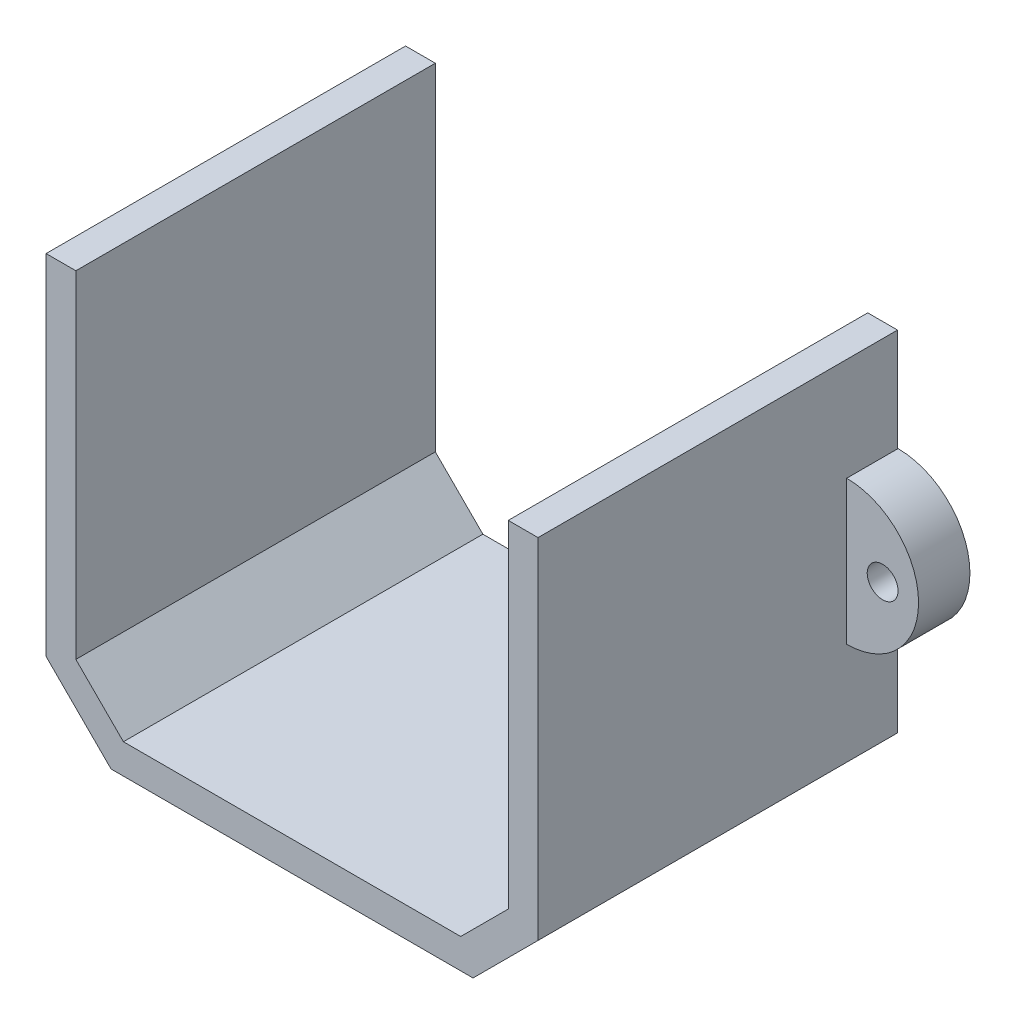
ISO-10303-21;
HEADER;
FILE_DESCRIPTION(('STEP AP214'),'2;1');
FILE_NAME('part.step','',(''),(''),'','','');
FILE_SCHEMA(('AUTOMOTIVE_DESIGN { 1 0 10303 214 1 1 1 1 }'));
ENDSEC;
DATA;
#1=APPLICATION_CONTEXT('core data for automotive mechanical design processes');
#2=APPLICATION_PROTOCOL_DEFINITION('international standard','automotive_design',2000,#1);
#3=PRODUCT_CONTEXT('',#1,'mechanical');
#4=PRODUCT('Part','Part','',(#3));
#5=PRODUCT_RELATED_PRODUCT_CATEGORY('part','',(#4));
#6=PRODUCT_DEFINITION_FORMATION('','',#4);
#7=PRODUCT_DEFINITION_CONTEXT('part definition',#1,'design');
#8=PRODUCT_DEFINITION('design','',#6,#7);
#9=PRODUCT_DEFINITION_SHAPE('','',#8);
#10=(LENGTH_UNIT() NAMED_UNIT(*) SI_UNIT(.MILLI.,.METRE.));
#11=(NAMED_UNIT(*) PLANE_ANGLE_UNIT() SI_UNIT($,.RADIAN.));
#12=(NAMED_UNIT(*) SI_UNIT($,.STERADIAN.) SOLID_ANGLE_UNIT());
#13=UNCERTAINTY_MEASURE_WITH_UNIT(LENGTH_MEASURE(1.E-05),#10,'distance_accuracy_value','');
#14=(GEOMETRIC_REPRESENTATION_CONTEXT(3) GLOBAL_UNCERTAINTY_ASSIGNED_CONTEXT((#13)) GLOBAL_UNIT_ASSIGNED_CONTEXT((#10,
#11,#12)) REPRESENTATION_CONTEXT('',''));
#15=CARTESIAN_POINT('',(0.,0.,0.));
#16=DIRECTION('',(0.,0.,1.));
#17=DIRECTION('',(1.,0.,0.));
#18=AXIS2_PLACEMENT_3D('',#15,#16,#17);
#19=CARTESIAN_POINT('',(-23.9417293796152,0.,5.));
#20=DIRECTION('',(1.,0.,0.));
#21=DIRECTION('',(0.,0.,-1.));
#22=AXIS2_PLACEMENT_3D('',#19,#20,#21);
#23=PLANE('',#22);
#24=DIRECTION('',(0.,-1.,0.));
#25=VECTOR('',#24,1.);
#26=CARTESIAN_POINT('',(-23.9417293796152,0.,0.));
#27=LINE('',#26,#25);
#28=CARTESIAN_POINT('',(-23.9417293796152,167.03858808641,0.));
#29=VERTEX_POINT('',#28);
#30=CARTESIAN_POINT('',(-23.9417293796152,153.03858808641,0.));
#31=VERTEX_POINT('',#30);
#32=EDGE_CURVE('E78',#29,#31,#27,.T.);
#33=ORIENTED_EDGE('',*,*,#32,.F.);
#34=DIRECTION('',(0.,0.,-1.));
#35=VECTOR('',#34,1.);
#36=CARTESIAN_POINT('',(-23.9417293796152,167.03858808641,5.));
#37=LINE('',#36,#35);
#38=CARTESIAN_POINT('',(-23.9417293796152,167.03858808641,5.));
#39=VERTEX_POINT('',#38);
#40=EDGE_CURVE('E12',#39,#29,#37,.T.);
#41=ORIENTED_EDGE('',*,*,#40,.F.);
#42=DIRECTION('',(0.,-1.,0.));
#43=VECTOR('',#42,1.);
#44=CARTESIAN_POINT('',(-23.9417293796152,0.,5.));
#45=LINE('',#44,#43);
#46=CARTESIAN_POINT('',(-23.9417293796152,153.03858808641,5.));
#47=VERTEX_POINT('',#46);
#48=EDGE_CURVE('E79',#39,#47,#45,.T.);
#49=ORIENTED_EDGE('',*,*,#48,.T.);
#50=DIRECTION('',(0.,0.,-1.));
#51=VECTOR('',#50,1.);
#52=CARTESIAN_POINT('',(-23.9417293796152,153.03858808641,5.));
#53=LINE('',#52,#51);
#54=EDGE_CURVE('E58',#47,#31,#53,.T.);
#55=ORIENTED_EDGE('',*,*,#54,.T.);
#56=EDGE_LOOP('',(#33,#41,#49,#55));
#57=FACE_BOUND('',#56,.T.);
#58=ADVANCED_FACE('F49',(#57),#23,.T.);
#59=CARTESIAN_POINT('',(-27.4417293796152,160.03858808641,5.));
#60=DIRECTION('',(0.,0.,-1.));
#61=DIRECTION('',(-1.,0.,0.));
#62=AXIS2_PLACEMENT_3D('',#59,#60,#61);
#63=CYLINDRICAL_SURFACE('',#62,1.5);
#64=CARTESIAN_POINT('',(-27.4417293796152,160.03858808641,5.));
#65=DIRECTION('',(0.,0.,1.));
#66=DIRECTION('',(1.,0.,0.));
#67=AXIS2_PLACEMENT_3D('',#64,#65,#66);
#68=CIRCLE('',#67,1.5);
#69=CARTESIAN_POINT('',(-25.9417293796152,160.03858808641,5.));
#70=VERTEX_POINT('',#69);
#71=EDGE_CURVE('E83',#70,#70,#68,.T.);
#72=ORIENTED_EDGE('',*,*,#71,.T.);
#73=EDGE_LOOP('',(#72));
#74=FACE_BOUND('',#73,.T.);
#75=CARTESIAN_POINT('',(-27.4417293796152,160.03858808641,0.));
#76=DIRECTION('',(0.,0.,1.));
#77=DIRECTION('',(1.,0.,0.));
#78=AXIS2_PLACEMENT_3D('',#75,#76,#77);
#79=CIRCLE('',#78,1.5);
#80=CARTESIAN_POINT('',(-25.9417293796152,160.03858808641,0.));
#81=VERTEX_POINT('',#80);
#82=EDGE_CURVE('E86',#81,#81,#79,.T.);
#83=ORIENTED_EDGE('',*,*,#82,.F.);
#84=EDGE_LOOP('',(#83));
#85=FACE_BOUND('',#84,.T.);
#86=ADVANCED_FACE('F51',(#74,#85),#63,.F.);
#87=CARTESIAN_POINT('',(-23.9417293796152,160.03858808641,5.));
#88=DIRECTION('',(0.,0.,-1.));
#89=DIRECTION('',(-1.,0.,0.));
#90=AXIS2_PLACEMENT_3D('',#87,#88,#89);
#91=CYLINDRICAL_SURFACE('',#90,7.00000000000001);
#92=CARTESIAN_POINT('',(-23.9417293796152,160.03858808641,0.));
#93=DIRECTION('',(0.,0.,1.));
#94=DIRECTION('',(1.,0.,0.));
#95=AXIS2_PLACEMENT_3D('',#92,#93,#94);
#96=CIRCLE('',#95,7.00000000000001);
#97=EDGE_CURVE('E80',#29,#31,#96,.T.);
#98=ORIENTED_EDGE('',*,*,#97,.T.);
#99=ORIENTED_EDGE('',*,*,#54,.F.);
#100=CARTESIAN_POINT('',(-23.9417293796152,160.03858808641,5.));
#101=DIRECTION('',(0.,0.,1.));
#102=DIRECTION('',(1.,0.,0.));
#103=AXIS2_PLACEMENT_3D('',#100,#101,#102);
#104=CIRCLE('',#103,7.00000000000001);
#105=EDGE_CURVE('E65',#39,#47,#104,.T.);
#106=ORIENTED_EDGE('',*,*,#105,.F.);
#107=ORIENTED_EDGE('',*,*,#40,.T.);
#108=EDGE_LOOP('',(#98,#99,#106,#107));
#109=FACE_BOUND('',#108,.T.);
#110=ADVANCED_FACE('F81',(#109),#91,.T.);
#111=CARTESIAN_POINT('',(0.,0.,5.));
#112=DIRECTION('',(0.,0.,1.));
#113=DIRECTION('',(1.,0.,0.));
#114=AXIS2_PLACEMENT_3D('',#111,#112,#113);
#115=PLANE('',#114);
#116=ORIENTED_EDGE('',*,*,#71,.F.);
#117=EDGE_LOOP('',(#116));
#118=FACE_BOUND('',#117,.T.);
#119=ORIENTED_EDGE('',*,*,#48,.F.);
#120=ORIENTED_EDGE('',*,*,#105,.T.);
#121=EDGE_LOOP('',(#119,#120));
#122=FACE_BOUND('',#121,.T.);
#123=ADVANCED_FACE('F98',(#118,#122),#115,.T.);
#124=CARTESIAN_POINT('',(0.,0.,0.));
#125=DIRECTION('',(0.,0.,1.));
#126=DIRECTION('',(1.,0.,0.));
#127=AXIS2_PLACEMENT_3D('',#124,#125,#126);
#128=PLANE('',#127);
#129=ORIENTED_EDGE('',*,*,#82,.T.);
#130=EDGE_LOOP('',(#129));
#131=FACE_BOUND('',#130,.T.);
#132=ORIENTED_EDGE('',*,*,#32,.T.);
#133=ORIENTED_EDGE('',*,*,#97,.F.);
#134=EDGE_LOOP('',(#132,#133));
#135=FACE_BOUND('',#134,.T.);
#136=ADVANCED_FACE('F85',(#131,#135),#128,.F.);
#137=CLOSED_SHELL('',(#58,#86,#110,#123,#136));
#138=MANIFOLD_SOLID_BREP('B2',#137);
#139=CARTESIAN_POINT('',(24.0582706203849,160.03858808641,5.));
#140=DIRECTION('',(0.,0.,-1.));
#141=DIRECTION('',(-1.,0.,0.));
#142=AXIS2_PLACEMENT_3D('',#139,#140,#141);
#143=CYLINDRICAL_SURFACE('',#142,7.00000000000001);
#144=CARTESIAN_POINT('',(24.0582706203849,160.03858808641,0.));
#145=DIRECTION('',(0.,0.,1.));
#146=DIRECTION('',(1.,0.,0.));
#147=AXIS2_PLACEMENT_3D('',#144,#145,#146);
#148=CIRCLE('',#147,7.00000000000001);
#149=CARTESIAN_POINT('',(24.0582706203849,167.03858808641,0.));
#150=VERTEX_POINT('',#149);
#151=CARTESIAN_POINT('',(24.0582706203849,153.03858808641,0.));
#152=VERTEX_POINT('',#151);
#153=EDGE_CURVE('E186',#150,#152,#148,.F.);
#154=ORIENTED_EDGE('',*,*,#153,.F.);
#155=DIRECTION('',(0.,0.,-1.));
#156=VECTOR('',#155,1.);
#157=CARTESIAN_POINT('',(24.0582706203849,167.03858808641,5.));
#158=LINE('',#157,#156);
#159=CARTESIAN_POINT('',(24.0582706203849,167.03858808641,5.));
#160=VERTEX_POINT('',#159);
#161=EDGE_CURVE('E47',#160,#150,#158,.T.);
#162=ORIENTED_EDGE('',*,*,#161,.F.);
#163=CARTESIAN_POINT('',(24.0582706203849,160.03858808641,5.));
#164=DIRECTION('',(0.,0.,1.));
#165=DIRECTION('',(1.,0.,0.));
#166=AXIS2_PLACEMENT_3D('',#163,#164,#165);
#167=CIRCLE('',#166,7.00000000000001);
#168=CARTESIAN_POINT('',(24.0582706203849,153.03858808641,5.));
#169=VERTEX_POINT('',#168);
#170=EDGE_CURVE('E189',#160,#169,#167,.F.);
#171=ORIENTED_EDGE('',*,*,#170,.T.);
#172=DIRECTION('',(0.,0.,-1.));
#173=VECTOR('',#172,1.);
#174=CARTESIAN_POINT('',(24.0582706203849,153.03858808641,5.));
#175=LINE('',#174,#173);
#176=EDGE_CURVE('E171',#169,#152,#175,.T.);
#177=ORIENTED_EDGE('',*,*,#176,.T.);
#178=EDGE_LOOP('',(#154,#162,#171,#177));
#179=FACE_BOUND('',#178,.T.);
#180=ADVANCED_FACE('F163',(#179),#143,.T.);
#181=CARTESIAN_POINT('',(24.0582706203849,0.,5.));
#182=DIRECTION('',(-1.,0.,0.));
#183=DIRECTION('',(0.,0.,1.));
#184=AXIS2_PLACEMENT_3D('',#181,#182,#183);
#185=PLANE('',#184);
#186=DIRECTION('',(0.,1.,0.));
#187=VECTOR('',#186,1.);
#188=CARTESIAN_POINT('',(24.0582706203849,0.,0.));
#189=LINE('',#188,#187);
#190=EDGE_CURVE('E195',#152,#150,#189,.T.);
#191=ORIENTED_EDGE('',*,*,#190,.F.);
#192=ORIENTED_EDGE('',*,*,#176,.F.);
#193=DIRECTION('',(0.,1.,0.));
#194=VECTOR('',#193,1.);
#195=CARTESIAN_POINT('',(24.0582706203849,0.,5.));
#196=LINE('',#195,#194);
#197=EDGE_CURVE('E205',#169,#160,#196,.T.);
#198=ORIENTED_EDGE('',*,*,#197,.T.);
#199=ORIENTED_EDGE('',*,*,#161,.T.);
#200=EDGE_LOOP('',(#191,#192,#198,#199));
#201=FACE_BOUND('',#200,.T.);
#202=ADVANCED_FACE('F197',(#201),#185,.T.);
#203=CARTESIAN_POINT('',(27.5582706203849,160.03858808641,5.));
#204=DIRECTION('',(0.,0.,-1.));
#205=DIRECTION('',(-1.,0.,0.));
#206=AXIS2_PLACEMENT_3D('',#203,#204,#205);
#207=CYLINDRICAL_SURFACE('',#206,1.5);
#208=CARTESIAN_POINT('',(27.5582706203849,160.03858808641,5.));
#209=DIRECTION('',(0.,0.,1.));
#210=DIRECTION('',(1.,0.,0.));
#211=AXIS2_PLACEMENT_3D('',#208,#209,#210);
#212=CIRCLE('',#211,1.5);
#213=CARTESIAN_POINT('',(29.0582706203849,160.03858808641,5.));
#214=VERTEX_POINT('',#213);
#215=EDGE_CURVE('E191',#214,#214,#212,.F.);
#216=ORIENTED_EDGE('',*,*,#215,.F.);
#217=EDGE_LOOP('',(#216));
#218=FACE_BOUND('',#217,.T.);
#219=CARTESIAN_POINT('',(27.5582706203849,160.03858808641,0.));
#220=DIRECTION('',(0.,0.,1.));
#221=DIRECTION('',(1.,0.,0.));
#222=AXIS2_PLACEMENT_3D('',#219,#220,#221);
#223=CIRCLE('',#222,1.5);
#224=CARTESIAN_POINT('',(29.0582706203849,160.03858808641,0.));
#225=VERTEX_POINT('',#224);
#226=EDGE_CURVE('E198',#225,#225,#223,.F.);
#227=ORIENTED_EDGE('',*,*,#226,.T.);
#228=EDGE_LOOP('',(#227));
#229=FACE_BOUND('',#228,.T.);
#230=ADVANCED_FACE('F211',(#218,#229),#207,.F.);
#231=CARTESIAN_POINT('',(0.,0.,5.));
#232=DIRECTION('',(0.,0.,1.));
#233=DIRECTION('',(1.,0.,0.));
#234=AXIS2_PLACEMENT_3D('',#231,#232,#233);
#235=PLANE('',#234);
#236=ORIENTED_EDGE('',*,*,#170,.F.);
#237=ORIENTED_EDGE('',*,*,#197,.F.);
#238=EDGE_LOOP('',(#236,#237));
#239=FACE_BOUND('',#238,.T.);
#240=ORIENTED_EDGE('',*,*,#215,.T.);
#241=EDGE_LOOP('',(#240));
#242=FACE_BOUND('',#241,.T.);
#243=ADVANCED_FACE('F208',(#239,#242),#235,.T.);
#244=CARTESIAN_POINT('',(0.,0.,0.));
#245=DIRECTION('',(0.,0.,1.));
#246=DIRECTION('',(1.,0.,0.));
#247=AXIS2_PLACEMENT_3D('',#244,#245,#246);
#248=PLANE('',#247);
#249=ORIENTED_EDGE('',*,*,#153,.T.);
#250=ORIENTED_EDGE('',*,*,#190,.T.);
#251=EDGE_LOOP('',(#249,#250));
#252=FACE_BOUND('',#251,.T.);
#253=ORIENTED_EDGE('',*,*,#226,.F.);
#254=EDGE_LOOP('',(#253));
#255=FACE_BOUND('',#254,.T.);
#256=ADVANCED_FACE('F193',(#252,#255),#248,.F.);
#257=CLOSED_SHELL('',(#180,#202,#230,#243,#256));
#258=MANIFOLD_SOLID_BREP('B6',#257);
#259=CARTESIAN_POINT('',(21.1082706203848,0.,35.));
#260=DIRECTION('',(-1.,0.,0.));
#261=DIRECTION('',(0.,0.,1.));
#262=AXIS2_PLACEMENT_3D('',#259,#260,#261);
#263=PLANE('',#262);
#264=DIRECTION('',(0.,1.,0.));
#265=VECTOR('',#264,1.);
#266=CARTESIAN_POINT('',(21.1082706203848,0.,0.));
#267=LINE('',#266,#265);
#268=CARTESIAN_POINT('',(21.1082706203848,144.239197751451,0.));
#269=VERTEX_POINT('',#268);
#270=CARTESIAN_POINT('',(21.1082706203848,177.009908430369,0.));
#271=VERTEX_POINT('',#270);
#272=EDGE_CURVE('E388',#269,#271,#267,.T.);
#273=ORIENTED_EDGE('',*,*,#272,.F.);
#274=DIRECTION('',(0.,0.,-1.));
#275=VECTOR('',#274,1.);
#276=CARTESIAN_POINT('',(21.1082706203848,144.239197751451,35.));
#277=LINE('',#276,#275);
#278=CARTESIAN_POINT('',(21.1082706203848,144.239197751451,35.));
#279=VERTEX_POINT('',#278);
#280=EDGE_CURVE('E161',#279,#269,#277,.T.);
#281=ORIENTED_EDGE('',*,*,#280,.F.);
#282=DIRECTION('',(0.,1.,0.));
#283=VECTOR('',#282,1.);
#284=CARTESIAN_POINT('',(21.1082706203848,0.,35.));
#285=LINE('',#284,#283);
#286=CARTESIAN_POINT('',(21.1082706203848,177.009908430369,35.));
#287=VERTEX_POINT('',#286);
#288=EDGE_CURVE('E420',#279,#287,#285,.T.);
#289=ORIENTED_EDGE('',*,*,#288,.T.);
#290=DIRECTION('',(0.,0.,-1.));
#291=VECTOR('',#290,1.);
#292=CARTESIAN_POINT('',(21.1082706203848,177.009908430369,35.));
#293=LINE('',#292,#291);
#294=EDGE_CURVE('E284',#287,#271,#293,.T.);
#295=ORIENTED_EDGE('',*,*,#294,.T.);
#296=EDGE_LOOP('',(#273,#281,#289,#295));
#297=FACE_BOUND('',#296,.T.);
#298=ADVANCED_FACE('F268',(#297),#263,.T.);
#299=CARTESIAN_POINT('',(-61.5654635655329,61.565463565533,35.));
#300=DIRECTION('',(0.707106781186547,-0.707106781186548,0.));
#301=DIRECTION('',(0.707106781186548,0.707106781186547,0.));
#302=AXIS2_PLACEMENT_3D('',#299,#300,#301);
#303=PLANE('',#302);
#304=DIRECTION('',(-0.707106781186548,-0.707106781186547,0.));
#305=VECTOR('',#304,1.);
#306=CARTESIAN_POINT('',(-61.5654635655329,61.565463565533,0.));
#307=LINE('',#306,#305);
#308=CARTESIAN_POINT('',(16.4789812989034,139.609908429969,0.));
#309=VERTEX_POINT('',#308);
#310=EDGE_CURVE('E390',#269,#309,#307,.T.);
#311=ORIENTED_EDGE('',*,*,#310,.T.);
#312=DIRECTION('',(0.,0.,-1.));
#313=VECTOR('',#312,1.);
#314=CARTESIAN_POINT('',(16.4789812989034,139.609908429969,35.));
#315=LINE('',#314,#313);
#316=CARTESIAN_POINT('',(16.4789812989034,139.609908429969,35.));
#317=VERTEX_POINT('',#316);
#318=EDGE_CURVE('E276',#317,#309,#315,.T.);
#319=ORIENTED_EDGE('',*,*,#318,.F.);
#320=DIRECTION('',(-0.707106781186548,-0.707106781186547,0.));
#321=VECTOR('',#320,1.);
#322=CARTESIAN_POINT('',(-61.5654635655329,61.565463565533,35.));
#323=LINE('',#322,#321);
#324=EDGE_CURVE('E458',#279,#317,#323,.T.);
#325=ORIENTED_EDGE('',*,*,#324,.F.);
#326=ORIENTED_EDGE('',*,*,#280,.T.);
#327=EDGE_LOOP('',(#311,#319,#325,#326));
#328=FACE_BOUND('',#327,.T.);
#329=ADVANCED_FACE('F444',(#328),#303,.F.);
#330=CARTESIAN_POINT('',(0.,139.609908429969,35.));
#331=DIRECTION('',(0.,1.,0.));
#332=DIRECTION('',(0.,0.,1.));
#333=AXIS2_PLACEMENT_3D('',#330,#331,#332);
#334=PLANE('',#333);
#335=DIRECTION('',(1.,0.,0.));
#336=VECTOR('',#335,1.);
#337=CARTESIAN_POINT('',(0.,139.609908429969,0.));
#338=LINE('',#337,#336);
#339=CARTESIAN_POINT('',(-16.3624400581339,139.609908429969,0.));
#340=VERTEX_POINT('',#339);
#341=EDGE_CURVE('E393',#340,#309,#338,.T.);
#342=ORIENTED_EDGE('',*,*,#341,.F.);
#343=DIRECTION('',(0.,0.,-1.));
#344=VECTOR('',#343,1.);
#345=CARTESIAN_POINT('',(-16.3624400581339,139.609908429969,35.));
#346=LINE('',#345,#344);
#347=CARTESIAN_POINT('',(-16.3624400581339,139.609908429969,35.));
#348=VERTEX_POINT('',#347);
#349=EDGE_CURVE('E434',#348,#340,#346,.T.);
#350=ORIENTED_EDGE('',*,*,#349,.F.);
#351=DIRECTION('',(1.,0.,0.));
#352=VECTOR('',#351,1.);
#353=CARTESIAN_POINT('',(0.,139.609908429969,35.));
#354=LINE('',#353,#352);
#355=EDGE_CURVE('E441',#348,#317,#354,.T.);
#356=ORIENTED_EDGE('',*,*,#355,.T.);
#357=ORIENTED_EDGE('',*,*,#318,.T.);
#358=EDGE_LOOP('',(#342,#350,#356,#357));
#359=FACE_BOUND('',#358,.T.);
#360=ADVANCED_FACE('F439',(#359),#334,.T.);
#361=CARTESIAN_POINT('',(61.6237341859177,61.6237341859176,35.));
#362=DIRECTION('',(-0.707106781186548,-0.707106781186547,0.));
#363=DIRECTION('',(0.707106781186547,-0.707106781186548,0.));
#364=AXIS2_PLACEMENT_3D('',#361,#362,#363);
#365=PLANE('',#364);
#366=DIRECTION('',(-0.707106781186547,0.707106781186548,0.));
#367=VECTOR('',#366,1.);
#368=CARTESIAN_POINT('',(61.6237341859177,61.6237341859176,0.));
#369=LINE('',#368,#367);
#370=CARTESIAN_POINT('',(-20.9917293796153,144.239197751451,0.));
#371=VERTEX_POINT('',#370);
#372=EDGE_CURVE('E396',#340,#371,#369,.T.);
#373=ORIENTED_EDGE('',*,*,#372,.T.);
#374=DIRECTION('',(0.,0.,-1.));
#375=VECTOR('',#374,1.);
#376=CARTESIAN_POINT('',(-20.9917293796153,144.239197751451,35.));
#377=LINE('',#376,#375);
#378=CARTESIAN_POINT('',(-20.9917293796153,144.239197751451,35.));
#379=VERTEX_POINT('',#378);
#380=EDGE_CURVE('E432',#379,#371,#377,.T.);
#381=ORIENTED_EDGE('',*,*,#380,.F.);
#382=DIRECTION('',(-0.707106781186547,0.707106781186548,0.));
#383=VECTOR('',#382,1.);
#384=CARTESIAN_POINT('',(61.6237341859177,61.6237341859176,35.));
#385=LINE('',#384,#383);
#386=EDGE_CURVE('E454',#348,#379,#385,.T.);
#387=ORIENTED_EDGE('',*,*,#386,.F.);
#388=ORIENTED_EDGE('',*,*,#349,.T.);
#389=EDGE_LOOP('',(#373,#381,#387,#388));
#390=FACE_BOUND('',#389,.T.);
#391=ADVANCED_FACE('F451',(#390),#365,.F.);
#392=CARTESIAN_POINT('',(-20.9917293796153,0.,35.));
#393=DIRECTION('',(1.,0.,0.));
#394=DIRECTION('',(0.,0.,-1.));
#395=AXIS2_PLACEMENT_3D('',#392,#393,#394);
#396=PLANE('',#395);
#397=DIRECTION('',(0.,-1.,0.));
#398=VECTOR('',#397,1.);
#399=CARTESIAN_POINT('',(-20.9917293796153,0.,0.));
#400=LINE('',#399,#398);
#401=CARTESIAN_POINT('',(-20.9917293796153,177.009908430369,0.));
#402=VERTEX_POINT('',#401);
#403=EDGE_CURVE('E399',#402,#371,#400,.T.);
#404=ORIENTED_EDGE('',*,*,#403,.F.);
#405=DIRECTION('',(0.,0.,-1.));
#406=VECTOR('',#405,1.);
#407=CARTESIAN_POINT('',(-20.9917293796153,177.009908430369,35.));
#408=LINE('',#407,#406);
#409=CARTESIAN_POINT('',(-20.9917293796153,177.009908430369,35.));
#410=VERTEX_POINT('',#409);
#411=EDGE_CURVE('E430',#410,#402,#408,.T.);
#412=ORIENTED_EDGE('',*,*,#411,.F.);
#413=DIRECTION('',(0.,-1.,0.));
#414=VECTOR('',#413,1.);
#415=CARTESIAN_POINT('',(-20.9917293796153,0.,35.));
#416=LINE('',#415,#414);
#417=EDGE_CURVE('E456',#410,#379,#416,.T.);
#418=ORIENTED_EDGE('',*,*,#417,.T.);
#419=ORIENTED_EDGE('',*,*,#380,.T.);
#420=EDGE_LOOP('',(#404,#412,#418,#419));
#421=FACE_BOUND('',#420,.T.);
#422=ADVANCED_FACE('F562',(#421),#396,.T.);
#423=CARTESIAN_POINT('',(0.,177.009908430369,35.));
#424=DIRECTION('',(0.,1.,0.));
#425=DIRECTION('',(0.,0.,1.));
#426=AXIS2_PLACEMENT_3D('',#423,#424,#425);
#427=PLANE('',#426);
#428=DIRECTION('',(1.,0.,0.));
#429=VECTOR('',#428,1.);
#430=CARTESIAN_POINT('',(0.,177.009908430369,0.));
#431=LINE('',#430,#429);
#432=CARTESIAN_POINT('',(-23.8917293796153,177.009908430369,0.));
#433=VERTEX_POINT('',#432);
#434=EDGE_CURVE('E402',#433,#402,#431,.T.);
#435=ORIENTED_EDGE('',*,*,#434,.F.);
#436=DIRECTION('',(0.,0.,-1.));
#437=VECTOR('',#436,1.);
#438=CARTESIAN_POINT('',(-23.8917293796153,177.009908430369,35.));
#439=LINE('',#438,#437);
#440=CARTESIAN_POINT('',(-23.8917293796153,177.009908430369,35.));
#441=VERTEX_POINT('',#440);
#442=EDGE_CURVE('E428',#441,#433,#439,.T.);
#443=ORIENTED_EDGE('',*,*,#442,.F.);
#444=DIRECTION('',(1.,0.,0.));
#445=VECTOR('',#444,1.);
#446=CARTESIAN_POINT('',(0.,177.009908430369,35.));
#447=LINE('',#446,#445);
#448=EDGE_CURVE('E464',#441,#410,#447,.T.);
#449=ORIENTED_EDGE('',*,*,#448,.T.);
#450=ORIENTED_EDGE('',*,*,#411,.T.);
#451=EDGE_LOOP('',(#435,#443,#449,#450));
#452=FACE_BOUND('',#451,.T.);
#453=ADVANCED_FACE('F552',(#452),#427,.T.);
#454=CARTESIAN_POINT('',(-23.8917293796153,0.,35.));
#455=DIRECTION('',(1.,0.,0.));
#456=DIRECTION('',(0.,0.,-1.));
#457=AXIS2_PLACEMENT_3D('',#454,#455,#456);
#458=PLANE('',#457);
#459=DIRECTION('',(0.,-1.,0.));
#460=VECTOR('',#459,1.);
#461=CARTESIAN_POINT('',(-23.8917293796153,0.,0.));
#462=LINE('',#461,#460);
#463=CARTESIAN_POINT('',(-23.8917293796152,143.037978420569,0.));
#464=VERTEX_POINT('',#463);
#465=EDGE_CURVE('E405',#433,#464,#462,.T.);
#466=ORIENTED_EDGE('',*,*,#465,.T.);
#467=DIRECTION('',(0.,0.,-1.));
#468=VECTOR('',#467,1.);
#469=CARTESIAN_POINT('',(-23.8917293796152,143.037978420569,35.));
#470=LINE('',#469,#468);
#471=CARTESIAN_POINT('',(-23.8917293796152,143.037978420569,35.));
#472=VERTEX_POINT('',#471);
#473=EDGE_CURVE('E426',#472,#464,#470,.T.);
#474=ORIENTED_EDGE('',*,*,#473,.F.);
#475=DIRECTION('',(0.,-1.,0.));
#476=VECTOR('',#475,1.);
#477=CARTESIAN_POINT('',(-23.8917293796153,0.,35.));
#478=LINE('',#477,#476);
#479=EDGE_CURVE('E467',#441,#472,#478,.T.);
#480=ORIENTED_EDGE('',*,*,#479,.F.);
#481=ORIENTED_EDGE('',*,*,#442,.T.);
#482=EDGE_LOOP('',(#466,#474,#480,#481));
#483=FACE_BOUND('',#482,.T.);
#484=ADVANCED_FACE('F476',(#483),#458,.F.);
#485=CARTESIAN_POINT('',(59.5731245204767,59.5731245204765,35.));
#486=DIRECTION('',(-0.707106781186548,-0.707106781186547,0.));
#487=DIRECTION('',(0.707106781186547,-0.707106781186548,0.));
#488=AXIS2_PLACEMENT_3D('',#485,#486,#487);
#489=PLANE('',#488);
#490=DIRECTION('',(-0.707106781186547,0.707106781186548,0.));
#491=VECTOR('',#490,1.);
#492=CARTESIAN_POINT('',(59.5731245204767,59.5731245204765,0.));
#493=LINE('',#492,#491);
#494=CARTESIAN_POINT('',(-17.5636593890159,136.709908429969,0.));
#495=VERTEX_POINT('',#494);
#496=EDGE_CURVE('E408',#495,#464,#493,.T.);
#497=ORIENTED_EDGE('',*,*,#496,.F.);
#498=DIRECTION('',(0.,0.,-1.));
#499=VECTOR('',#498,1.);
#500=CARTESIAN_POINT('',(-17.5636593890159,136.709908429969,35.));
#501=LINE('',#500,#499);
#502=CARTESIAN_POINT('',(-17.5636593890159,136.709908429969,35.));
#503=VERTEX_POINT('',#502);
#504=EDGE_CURVE('E424',#503,#495,#501,.T.);
#505=ORIENTED_EDGE('',*,*,#504,.F.);
#506=DIRECTION('',(-0.707106781186547,0.707106781186548,0.));
#507=VECTOR('',#506,1.);
#508=CARTESIAN_POINT('',(59.5731245204767,59.5731245204765,35.));
#509=LINE('',#508,#507);
#510=EDGE_CURVE('E383',#503,#472,#509,.T.);
#511=ORIENTED_EDGE('',*,*,#510,.T.);
#512=ORIENTED_EDGE('',*,*,#473,.T.);
#513=EDGE_LOOP('',(#497,#505,#511,#512));
#514=FACE_BOUND('',#513,.T.);
#515=ADVANCED_FACE('F471',(#514),#489,.T.);
#516=CARTESIAN_POINT('',(0.,136.709908429969,35.));
#517=DIRECTION('',(0.,1.,0.));
#518=DIRECTION('',(0.,0.,1.));
#519=AXIS2_PLACEMENT_3D('',#516,#517,#518);
#520=PLANE('',#519);
#521=DIRECTION('',(1.,0.,0.));
#522=VECTOR('',#521,1.);
#523=CARTESIAN_POINT('',(0.,136.709908429969,0.));
#524=LINE('',#523,#522);
#525=CARTESIAN_POINT('',(17.6802006297854,136.709908429969,0.));
#526=VERTEX_POINT('',#525);
#527=EDGE_CURVE('E411',#495,#526,#524,.T.);
#528=ORIENTED_EDGE('',*,*,#527,.T.);
#529=DIRECTION('',(0.,0.,-1.));
#530=VECTOR('',#529,1.);
#531=CARTESIAN_POINT('',(17.6802006297854,136.709908429969,35.));
#532=LINE('',#531,#530);
#533=CARTESIAN_POINT('',(17.6802006297854,136.709908429969,35.));
#534=VERTEX_POINT('',#533);
#535=EDGE_CURVE('E368',#534,#526,#532,.T.);
#536=ORIENTED_EDGE('',*,*,#535,.F.);
#537=DIRECTION('',(1.,0.,0.));
#538=VECTOR('',#537,1.);
#539=CARTESIAN_POINT('',(0.,136.709908429969,35.));
#540=LINE('',#539,#538);
#541=EDGE_CURVE('E380',#503,#534,#540,.T.);
#542=ORIENTED_EDGE('',*,*,#541,.F.);
#543=ORIENTED_EDGE('',*,*,#504,.T.);
#544=EDGE_LOOP('',(#528,#536,#542,#543));
#545=FACE_BOUND('',#544,.T.);
#546=ADVANCED_FACE('F481',(#545),#520,.F.);
#547=CARTESIAN_POINT('',(-59.5148539000919,59.5148539000919,35.));
#548=DIRECTION('',(0.707106781186547,-0.707106781186548,0.));
#549=DIRECTION('',(0.707106781186548,0.707106781186547,0.));
#550=AXIS2_PLACEMENT_3D('',#547,#548,#549);
#551=PLANE('',#550);
#552=DIRECTION('',(-0.707106781186548,-0.707106781186547,0.));
#553=VECTOR('',#552,1.);
#554=CARTESIAN_POINT('',(-59.5148539000919,59.5148539000919,0.));
#555=LINE('',#554,#553);
#556=CARTESIAN_POINT('',(24.0082706203847,143.037978420569,0.));
#557=VERTEX_POINT('',#556);
#558=EDGE_CURVE('E365',#557,#526,#555,.T.);
#559=ORIENTED_EDGE('',*,*,#558,.F.);
#560=DIRECTION('',(0.,0.,-1.));
#561=VECTOR('',#560,1.);
#562=CARTESIAN_POINT('',(24.0082706203847,143.037978420569,35.));
#563=LINE('',#562,#561);
#564=CARTESIAN_POINT('',(24.0082706203847,143.037978420569,35.));
#565=VERTEX_POINT('',#564);
#566=EDGE_CURVE('E359',#565,#557,#563,.T.);
#567=ORIENTED_EDGE('',*,*,#566,.F.);
#568=DIRECTION('',(-0.707106781186548,-0.707106781186547,0.));
#569=VECTOR('',#568,1.);
#570=CARTESIAN_POINT('',(-59.5148539000919,59.5148539000919,35.));
#571=LINE('',#570,#569);
#572=EDGE_CURVE('E363',#565,#534,#571,.T.);
#573=ORIENTED_EDGE('',*,*,#572,.T.);
#574=ORIENTED_EDGE('',*,*,#535,.T.);
#575=EDGE_LOOP('',(#559,#567,#573,#574));
#576=FACE_BOUND('',#575,.T.);
#577=ADVANCED_FACE('F361',(#576),#551,.T.);
#578=CARTESIAN_POINT('',(24.0082706203847,0.,35.));
#579=DIRECTION('',(-1.,0.,0.));
#580=DIRECTION('',(0.,0.,1.));
#581=AXIS2_PLACEMENT_3D('',#578,#579,#580);
#582=PLANE('',#581);
#583=DIRECTION('',(0.,1.,0.));
#584=VECTOR('',#583,1.);
#585=CARTESIAN_POINT('',(24.0082706203847,0.,0.));
#586=LINE('',#585,#584);
#587=CARTESIAN_POINT('',(24.0082706203847,177.009908430369,0.));
#588=VERTEX_POINT('',#587);
#589=EDGE_CURVE('E415',#557,#588,#586,.T.);
#590=ORIENTED_EDGE('',*,*,#589,.T.);
#591=DIRECTION('',(0.,0.,-1.));
#592=VECTOR('',#591,1.);
#593=CARTESIAN_POINT('',(24.0082706203847,177.009908430369,35.));
#594=LINE('',#593,#592);
#595=CARTESIAN_POINT('',(24.0082706203847,177.009908430369,35.));
#596=VERTEX_POINT('',#595);
#597=EDGE_CURVE('E322',#596,#588,#594,.T.);
#598=ORIENTED_EDGE('',*,*,#597,.F.);
#599=DIRECTION('',(0.,1.,0.));
#600=VECTOR('',#599,1.);
#601=CARTESIAN_POINT('',(24.0082706203847,0.,35.));
#602=LINE('',#601,#600);
#603=EDGE_CURVE('E370',#565,#596,#602,.T.);
#604=ORIENTED_EDGE('',*,*,#603,.F.);
#605=ORIENTED_EDGE('',*,*,#566,.T.);
#606=EDGE_LOOP('',(#590,#598,#604,#605));
#607=FACE_BOUND('',#606,.T.);
#608=ADVANCED_FACE('F371',(#607),#582,.F.);
#609=CARTESIAN_POINT('',(0.,177.009908430369,35.));
#610=DIRECTION('',(0.,1.,0.));
#611=DIRECTION('',(0.,0.,1.));
#612=AXIS2_PLACEMENT_3D('',#609,#610,#611);
#613=PLANE('',#612);
#614=DIRECTION('',(1.,0.,0.));
#615=VECTOR('',#614,1.);
#616=CARTESIAN_POINT('',(0.,177.009908430369,0.));
#617=LINE('',#616,#615);
#618=EDGE_CURVE('E417',#271,#588,#617,.T.);
#619=ORIENTED_EDGE('',*,*,#618,.F.);
#620=ORIENTED_EDGE('',*,*,#294,.F.);
#621=DIRECTION('',(1.,0.,0.));
#622=VECTOR('',#621,1.);
#623=CARTESIAN_POINT('',(0.,177.009908430369,35.));
#624=LINE('',#623,#622);
#625=EDGE_CURVE('E374',#287,#596,#624,.T.);
#626=ORIENTED_EDGE('',*,*,#625,.T.);
#627=ORIENTED_EDGE('',*,*,#597,.T.);
#628=EDGE_LOOP('',(#619,#620,#626,#627));
#629=FACE_BOUND('',#628,.T.);
#630=ADVANCED_FACE('F494',(#629),#613,.T.);
#631=CARTESIAN_POINT('',(0.,0.,35.));
#632=DIRECTION('',(0.,0.,1.));
#633=DIRECTION('',(1.,0.,0.));
#634=AXIS2_PLACEMENT_3D('',#631,#632,#633);
#635=PLANE('',#634);
#636=ORIENTED_EDGE('',*,*,#288,.F.);
#637=ORIENTED_EDGE('',*,*,#324,.T.);
#638=ORIENTED_EDGE('',*,*,#355,.F.);
#639=ORIENTED_EDGE('',*,*,#386,.T.);
#640=ORIENTED_EDGE('',*,*,#417,.F.);
#641=ORIENTED_EDGE('',*,*,#448,.F.);
#642=ORIENTED_EDGE('',*,*,#479,.T.);
#643=ORIENTED_EDGE('',*,*,#510,.F.);
#644=ORIENTED_EDGE('',*,*,#541,.T.);
#645=ORIENTED_EDGE('',*,*,#572,.F.);
#646=ORIENTED_EDGE('',*,*,#603,.T.);
#647=ORIENTED_EDGE('',*,*,#625,.F.);
#648=EDGE_LOOP('',(#636,#637,#638,#639,#640,#641,#642,#643,#644,#645,#646,#647));
#649=FACE_BOUND('',#648,.T.);
#650=ADVANCED_FACE('F377',(#649),#635,.T.);
#651=CARTESIAN_POINT('',(0.,0.,0.));
#652=DIRECTION('',(0.,0.,1.));
#653=DIRECTION('',(1.,0.,0.));
#654=AXIS2_PLACEMENT_3D('',#651,#652,#653);
#655=PLANE('',#654);
#656=ORIENTED_EDGE('',*,*,#272,.T.);
#657=ORIENTED_EDGE('',*,*,#618,.T.);
#658=ORIENTED_EDGE('',*,*,#589,.F.);
#659=ORIENTED_EDGE('',*,*,#558,.T.);
#660=ORIENTED_EDGE('',*,*,#527,.F.);
#661=ORIENTED_EDGE('',*,*,#496,.T.);
#662=ORIENTED_EDGE('',*,*,#465,.F.);
#663=ORIENTED_EDGE('',*,*,#434,.T.);
#664=ORIENTED_EDGE('',*,*,#403,.T.);
#665=ORIENTED_EDGE('',*,*,#372,.F.);
#666=ORIENTED_EDGE('',*,*,#341,.T.);
#667=ORIENTED_EDGE('',*,*,#310,.F.);
#668=EDGE_LOOP('',(#656,#657,#658,#659,#660,#661,#662,#663,#664,#665,#666,#667));
#669=FACE_BOUND('',#668,.T.);
#670=ADVANCED_FACE('F447',(#669),#655,.F.);
#671=CLOSED_SHELL('',(#298,#329,#360,#391,#422,#453,#484,#515,#546,#577,#608,#630,#650,#670));
#672=MANIFOLD_SOLID_BREP('B41',#671);
#673=ADVANCED_BREP_SHAPE_REPRESENTATION('',(#18,#138,#258,#672),#14);
#674=SHAPE_DEFINITION_REPRESENTATION(#9,#673);
ENDSEC;
END-ISO-10303-21;
